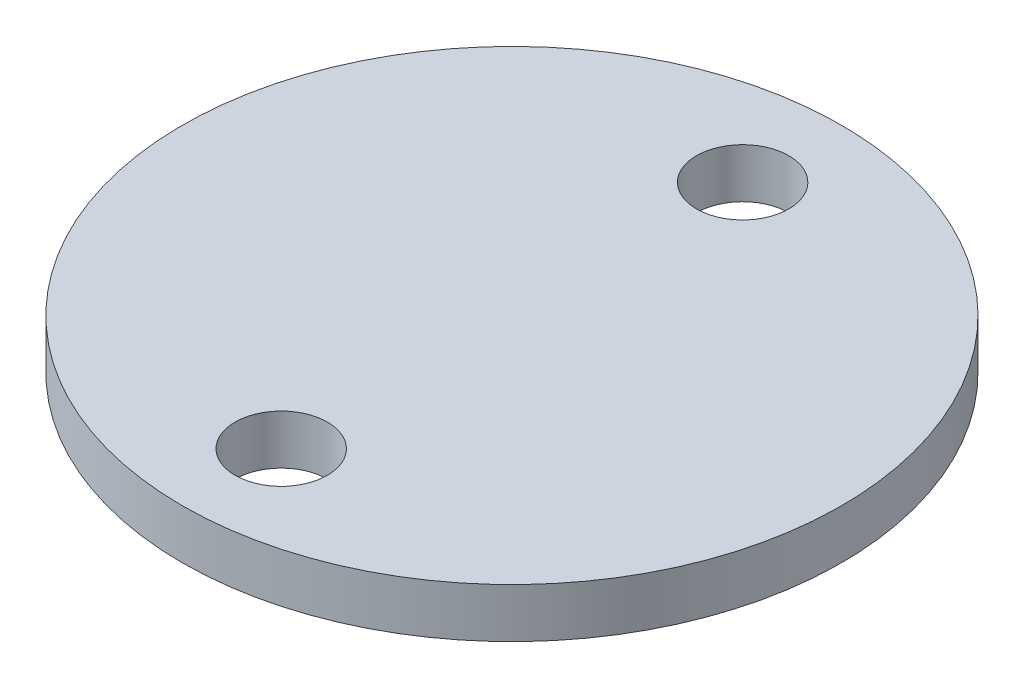
ISO-10303-21;
HEADER;
FILE_DESCRIPTION(('STEP AP214'),'2;1');
FILE_NAME('part.step','',(''),(''),'','','');
FILE_SCHEMA(('AUTOMOTIVE_DESIGN { 1 0 10303 214 1 1 1 1 }'));
ENDSEC;
DATA;
#1=APPLICATION_CONTEXT('core data for automotive mechanical design processes');
#2=APPLICATION_PROTOCOL_DEFINITION('international standard','automotive_design',2000,#1);
#3=PRODUCT_CONTEXT('',#1,'mechanical');
#4=PRODUCT('Part','Part','',(#3));
#5=PRODUCT_RELATED_PRODUCT_CATEGORY('part','',(#4));
#6=PRODUCT_DEFINITION_FORMATION('','',#4);
#7=PRODUCT_DEFINITION_CONTEXT('part definition',#1,'design');
#8=PRODUCT_DEFINITION('design','',#6,#7);
#9=PRODUCT_DEFINITION_SHAPE('','',#8);
#10=(LENGTH_UNIT() NAMED_UNIT(*) SI_UNIT(.MILLI.,.METRE.));
#11=(NAMED_UNIT(*) PLANE_ANGLE_UNIT() SI_UNIT($,.RADIAN.));
#12=(NAMED_UNIT(*) SI_UNIT($,.STERADIAN.) SOLID_ANGLE_UNIT());
#13=UNCERTAINTY_MEASURE_WITH_UNIT(LENGTH_MEASURE(1.E-05),#10,'distance_accuracy_value','');
#14=(GEOMETRIC_REPRESENTATION_CONTEXT(3) GLOBAL_UNCERTAINTY_ASSIGNED_CONTEXT((#13)) GLOBAL_UNIT_ASSIGNED_CONTEXT((#10,
#11,#12)) REPRESENTATION_CONTEXT('',''));
#15=CARTESIAN_POINT('',(0.,0.,0.));
#16=DIRECTION('',(0.,0.,1.));
#17=DIRECTION('',(1.,0.,0.));
#18=AXIS2_PLACEMENT_3D('',#15,#16,#17);
#19=CARTESIAN_POINT('',(0.,-1.5,0.));
#20=DIRECTION('',(0.,1.,0.));
#21=DIRECTION('',(0.,0.,1.));
#22=AXIS2_PLACEMENT_3D('',#19,#20,#21);
#23=PLANE('',#22);
#24=CARTESIAN_POINT('',(0.,-1.5,-7.));
#25=DIRECTION('',(0.,1.,0.));
#26=DIRECTION('',(0.,0.,1.));
#27=AXIS2_PLACEMENT_3D('',#24,#25,#26);
#28=CIRCLE('',#27,1.4);
#29=CARTESIAN_POINT('',(0.,-1.5,-5.6));
#30=VERTEX_POINT('',#29);
#31=EDGE_CURVE('E118',#30,#30,#28,.T.);
#32=ORIENTED_EDGE('',*,*,#31,.T.);
#33=EDGE_LOOP('',(#32));
#34=FACE_BOUND('',#33,.T.);
#35=CARTESIAN_POINT('',(0.,-1.5,7.));
#36=DIRECTION('',(0.,1.,0.));
#37=DIRECTION('',(0.,0.,1.));
#38=AXIS2_PLACEMENT_3D('',#35,#36,#37);
#39=CIRCLE('',#38,1.4);
#40=CARTESIAN_POINT('',(0.,-1.5,8.4));
#41=VERTEX_POINT('',#40);
#42=EDGE_CURVE('E117',#41,#41,#39,.T.);
#43=ORIENTED_EDGE('',*,*,#42,.T.);
#44=EDGE_LOOP('',(#43));
#45=FACE_BOUND('',#44,.T.);
#46=CARTESIAN_POINT('',(0.,-1.5,0.));
#47=DIRECTION('',(0.,1.,0.));
#48=DIRECTION('',(0.,0.,1.));
#49=AXIS2_PLACEMENT_3D('',#46,#47,#48);
#50=CIRCLE('',#49,10.);
#51=CARTESIAN_POINT('',(0.,-1.5,10.));
#52=VERTEX_POINT('',#51);
#53=EDGE_CURVE('E134',#52,#52,#50,.T.);
#54=ORIENTED_EDGE('',*,*,#53,.F.);
#55=EDGE_LOOP('',(#54));
#56=FACE_BOUND('',#55,.T.);
#57=CARTESIAN_POINT('',(0.,-1.5,0.));
#58=DIRECTION('',(0.,1.,0.));
#59=DIRECTION('',(0.,0.,1.));
#60=AXIS2_PLACEMENT_3D('',#57,#58,#59);
#61=CIRCLE('',#60,3.5);
#62=CARTESIAN_POINT('',(0.,-1.5,3.5));
#63=VERTEX_POINT('',#62);
#64=EDGE_CURVE('E138',#63,#63,#61,.F.);
#65=ORIENTED_EDGE('',*,*,#64,.F.);
#66=EDGE_LOOP('',(#65));
#67=FACE_BOUND('',#66,.T.);
#68=ADVANCED_FACE('F45',(#34,#45,#56,#67),#23,.F.);
#69=CARTESIAN_POINT('',(0.,-1.5,0.));
#70=DIRECTION('',(0.,1.,0.));
#71=DIRECTION('',(0.,0.,1.));
#72=AXIS2_PLACEMENT_3D('',#69,#70,#71);
#73=CYLINDRICAL_SURFACE('',#72,10.);
#74=ORIENTED_EDGE('',*,*,#53,.T.);
#75=EDGE_LOOP('',(#74));
#76=FACE_BOUND('',#75,.T.);
#77=CARTESIAN_POINT('',(0.,0.,0.));
#78=DIRECTION('',(0.,1.,0.));
#79=DIRECTION('',(0.,0.,1.));
#80=AXIS2_PLACEMENT_3D('',#77,#78,#79);
#81=CIRCLE('',#80,10.);
#82=CARTESIAN_POINT('',(0.,0.,10.));
#83=VERTEX_POINT('',#82);
#84=EDGE_CURVE('E122',#83,#83,#81,.T.);
#85=ORIENTED_EDGE('',*,*,#84,.F.);
#86=EDGE_LOOP('',(#85));
#87=FACE_BOUND('',#86,.T.);
#88=ADVANCED_FACE('F160',(#76,#87),#73,.T.);
#89=CARTESIAN_POINT('',(0.,0.,0.));
#90=DIRECTION('',(0.,1.,0.));
#91=DIRECTION('',(0.,0.,1.));
#92=AXIS2_PLACEMENT_3D('',#89,#90,#91);
#93=PLANE('',#92);
#94=CARTESIAN_POINT('',(0.,0.,-7.));
#95=DIRECTION('',(0.,1.,0.));
#96=DIRECTION('',(0.,0.,1.));
#97=AXIS2_PLACEMENT_3D('',#94,#95,#96);
#98=CIRCLE('',#97,1.4);
#99=CARTESIAN_POINT('',(0.,0.,-5.6));
#100=VERTEX_POINT('',#99);
#101=EDGE_CURVE('E123',#100,#100,#98,.T.);
#102=ORIENTED_EDGE('',*,*,#101,.F.);
#103=EDGE_LOOP('',(#102));
#104=FACE_BOUND('',#103,.T.);
#105=CARTESIAN_POINT('',(0.,0.,7.));
#106=DIRECTION('',(0.,1.,0.));
#107=DIRECTION('',(0.,0.,1.));
#108=AXIS2_PLACEMENT_3D('',#105,#106,#107);
#109=CIRCLE('',#108,1.4);
#110=CARTESIAN_POINT('',(0.,0.,8.4));
#111=VERTEX_POINT('',#110);
#112=EDGE_CURVE('E127',#111,#111,#109,.T.);
#113=ORIENTED_EDGE('',*,*,#112,.F.);
#114=EDGE_LOOP('',(#113));
#115=FACE_BOUND('',#114,.T.);
#116=ORIENTED_EDGE('',*,*,#84,.T.);
#117=EDGE_LOOP('',(#116));
#118=FACE_BOUND('',#117,.T.);
#119=ADVANCED_FACE('F164',(#104,#115,#118),#93,.T.);
#120=CARTESIAN_POINT('',(0.,-1.5,7.));
#121=DIRECTION('',(0.,1.,0.));
#122=DIRECTION('',(0.,0.,1.));
#123=AXIS2_PLACEMENT_3D('',#120,#121,#122);
#124=CYLINDRICAL_SURFACE('',#123,1.4);
#125=ORIENTED_EDGE('',*,*,#42,.F.);
#126=EDGE_LOOP('',(#125));
#127=FACE_BOUND('',#126,.T.);
#128=ORIENTED_EDGE('',*,*,#112,.T.);
#129=EDGE_LOOP('',(#128));
#130=FACE_BOUND('',#129,.T.);
#131=ADVANCED_FACE('F168',(#127,#130),#124,.F.);
#132=CARTESIAN_POINT('',(0.,-1.5,-7.));
#133=DIRECTION('',(0.,1.,0.));
#134=DIRECTION('',(0.,0.,1.));
#135=AXIS2_PLACEMENT_3D('',#132,#133,#134);
#136=CYLINDRICAL_SURFACE('',#135,1.4);
#137=ORIENTED_EDGE('',*,*,#31,.F.);
#138=EDGE_LOOP('',(#137));
#139=FACE_BOUND('',#138,.T.);
#140=ORIENTED_EDGE('',*,*,#101,.T.);
#141=EDGE_LOOP('',(#140));
#142=FACE_BOUND('',#141,.T.);
#143=ADVANCED_FACE('F174',(#139,#142),#136,.F.);
#144=CARTESIAN_POINT('',(0.,-5.,0.));
#145=DIRECTION('',(0.,-1.,0.));
#146=DIRECTION('',(0.,0.,-1.));
#147=AXIS2_PLACEMENT_3D('',#144,#145,#146);
#148=PLANE('',#147);
#149=CARTESIAN_POINT('',(0.,-5.,0.));
#150=DIRECTION('',(0.,-1.,0.));
#151=DIRECTION('',(0.,0.,-1.));
#152=AXIS2_PLACEMENT_3D('',#149,#150,#151);
#153=CIRCLE('',#152,3.08);
#154=CARTESIAN_POINT('',(2.6752986885261,-5.,-1.52616412196413));
#155=VERTEX_POINT('',#154);
#156=CARTESIAN_POINT('',(2.47560454785578,-5.,1.83242520246689));
#157=VERTEX_POINT('',#156);
#158=EDGE_CURVE('E67',#155,#157,#153,.F.);
#159=ORIENTED_EDGE('',*,*,#158,.T.);
#160=DIRECTION('',(-0.0593529225780543,0.,0.998237061314317));
#161=VECTOR('',#160,1.);
#162=CARTESIAN_POINT('',(2.57545161819094,-5.,0.15313054025138));
#163=LINE('',#162,#161);
#164=EDGE_CURVE('E60',#157,#155,#163,.F.);
#165=ORIENTED_EDGE('',*,*,#164,.T.);
#166=EDGE_LOOP('',(#159,#165));
#167=FACE_BOUND('',#166,.T.);
#168=CARTESIAN_POINT('',(0.,-5.,0.));
#169=DIRECTION('',(0.,-1.,0.));
#170=DIRECTION('',(0.,0.,-1.));
#171=AXIS2_PLACEMENT_3D('',#168,#169,#170);
#172=CIRCLE('',#171,3.5);
#173=CARTESIAN_POINT('',(0.,-5.,-3.5));
#174=VERTEX_POINT('',#173);
#175=EDGE_CURVE('E98',#174,#174,#172,.T.);
#176=ORIENTED_EDGE('',*,*,#175,.T.);
#177=EDGE_LOOP('',(#176));
#178=FACE_BOUND('',#177,.T.);
#179=ADVANCED_FACE('F178',(#167,#178),#148,.T.);
#180=CARTESIAN_POINT('',(0.,-5.,0.));
#181=DIRECTION('',(0.,1.,0.));
#182=DIRECTION('',(0.,0.,1.));
#183=AXIS2_PLACEMENT_3D('',#180,#181,#182);
#184=CYLINDRICAL_SURFACE('',#183,3.5);
#185=ORIENTED_EDGE('',*,*,#175,.F.);
#186=EDGE_LOOP('',(#185));
#187=FACE_BOUND('',#186,.T.);
#188=ORIENTED_EDGE('',*,*,#64,.T.);
#189=EDGE_LOOP('',(#188));
#190=FACE_BOUND('',#189,.T.);
#191=ADVANCED_FACE('F180',(#187,#190),#184,.T.);
#192=CARTESIAN_POINT('',(0.,-5.,0.));
#193=DIRECTION('',(0.,1.,0.));
#194=DIRECTION('',(0.,0.,1.));
#195=AXIS2_PLACEMENT_3D('',#192,#193,#194);
#196=CYLINDRICAL_SURFACE('',#195,2.58);
#197=DIRECTION('',(0.,1.,0.));
#198=VECTOR('',#197,1.);
#199=CARTESIAN_POINT('',(1.98573478321611,-5.,1.64719682209676));
#200=LINE('',#199,#198);
#201=CARTESIAN_POINT('',(1.98573478321611,-4.5,1.64719682209676));
#202=VERTEX_POINT('',#201);
#203=CARTESIAN_POINT('',(1.98573478321611,-1.5,1.64719682209676));
#204=VERTEX_POINT('',#203);
#205=EDGE_CURVE('E99',#202,#204,#200,.T.);
#206=ORIENTED_EDGE('',*,*,#205,.F.);
#207=CARTESIAN_POINT('',(0.,-4.5,0.));
#208=DIRECTION('',(0.,-1.,0.));
#209=DIRECTION('',(0.,0.,-1.));
#210=AXIS2_PLACEMENT_3D('',#207,#208,#209);
#211=CIRCLE('',#210,2.58);
#212=CARTESIAN_POINT('',(2.16693139185145,-4.5,-1.40028866417205));
#213=VERTEX_POINT('',#212);
#214=EDGE_CURVE('E11',#202,#213,#211,.T.);
#215=ORIENTED_EDGE('',*,*,#214,.T.);
#216=DIRECTION('',(0.,1.,0.));
#217=VECTOR('',#216,1.);
#218=CARTESIAN_POINT('',(2.16693139185145,-5.,-1.40028866417205));
#219=LINE('',#218,#217);
#220=CARTESIAN_POINT('',(2.16693139185145,-1.5,-1.40028866417205));
#221=VERTEX_POINT('',#220);
#222=EDGE_CURVE('E87',#213,#221,#219,.T.);
#223=ORIENTED_EDGE('',*,*,#222,.T.);
#224=CARTESIAN_POINT('',(0.,-1.5,0.));
#225=DIRECTION('',(0.,-1.,0.));
#226=DIRECTION('',(0.,0.,-1.));
#227=AXIS2_PLACEMENT_3D('',#224,#225,#226);
#228=CIRCLE('',#227,2.58);
#229=EDGE_CURVE('E92',#204,#221,#228,.T.);
#230=ORIENTED_EDGE('',*,*,#229,.F.);
#231=EDGE_LOOP('',(#206,#215,#223,#230));
#232=FACE_BOUND('',#231,.T.);
#233=ADVANCED_FACE('F90',(#232),#196,.F.);
#234=CARTESIAN_POINT('',(1.98573478321611,-5.,1.64719682209676));
#235=DIRECTION('',(-0.998237061314317,0.,-0.0593529225780542));
#236=DIRECTION('',(-0.0593529225780543,0.,0.998237061314317));
#237=AXIS2_PLACEMENT_3D('',#234,#235,#236);
#238=PLANE('',#237);
#239=ORIENTED_EDGE('',*,*,#222,.F.);
#240=DIRECTION('',(-0.0593529225780543,0.,0.998237061314317));
#241=VECTOR('',#240,1.);
#242=CARTESIAN_POINT('',(1.98573478321611,-4.5,1.64719682209676));
#243=LINE('',#242,#241);
#244=EDGE_CURVE('E145',#213,#202,#243,.T.);
#245=ORIENTED_EDGE('',*,*,#244,.T.);
#246=ORIENTED_EDGE('',*,*,#205,.T.);
#247=DIRECTION('',(-0.0593529225780542,0.,0.998237061314317));
#248=VECTOR('',#247,1.);
#249=CARTESIAN_POINT('',(1.98573478321611,-1.5,1.64719682209676));
#250=LINE('',#249,#248);
#251=EDGE_CURVE('E101',#221,#204,#250,.T.);
#252=ORIENTED_EDGE('',*,*,#251,.F.);
#253=EDGE_LOOP('',(#239,#245,#246,#252));
#254=FACE_BOUND('',#253,.T.);
#255=ADVANCED_FACE('F102',(#254),#238,.T.);
#256=ORIENTED_EDGE('',*,*,#251,.T.);
#257=ORIENTED_EDGE('',*,*,#229,.T.);
#258=EDGE_LOOP('',(#256,#257));
#259=FACE_BOUND('',#258,.T.);
#260=ADVANCED_FACE('F106',(#259),#23,.F.);
#261=CARTESIAN_POINT('',(0.,-4.5,0.));
#262=DIRECTION('',(0.,-1.,0.));
#263=DIRECTION('',(0.,0.,-1.));
#264=AXIS2_PLACEMENT_3D('',#261,#262,#263);
#265=TOROIDAL_SURFACE('',#264,3.08,0.5);
#266=CARTESIAN_POINT('',(1.98573478321611,-4.5,1.64719682209676));
#267=CARTESIAN_POINT('',(1.98570751333688,-4.5271506255322,1.64718405097706));
#268=CARTESIAN_POINT('',(1.98789750324852,-4.5542851739877,1.64805045423538));
#269=CARTESIAN_POINT('',(1.99650079260076,-4.60771122406625,1.6514431086882));
#270=CARTESIAN_POINT('',(2.00290487573119,-4.63400443442097,1.65396573765529));
#271=CARTESIAN_POINT('',(2.01972634119453,-4.68506043705291,1.66057294011781));
#272=CARTESIAN_POINT('',(2.03014350480648,-4.70982331265113,1.66465742848867));
#273=CARTESIAN_POINT('',(2.0546292670491,-4.75717862253918,1.67422008665459));
#274=CARTESIAN_POINT('',(2.06869860023212,-4.77977061895126,1.67969853680953));
#275=CARTESIAN_POINT('',(2.10039768824029,-4.82270912330445,1.69198337061502));
#276=CARTESIAN_POINT('',(2.11809954830483,-4.84299464958633,1.6988165335803));
#277=CARTESIAN_POINT('',(2.15633334761117,-4.88026896298054,1.71349435377744));
#278=CARTESIAN_POINT('',(2.17686629977642,-4.89725656488176,1.72133937297156));
#279=CARTESIAN_POINT('',(2.2212021491486,-4.92827824715827,1.73817852504377));
#280=CARTESIAN_POINT('',(2.24511254471425,-4.94213877843521,1.74720908046775));
#281=CARTESIAN_POINT('',(2.29474956357017,-4.96555555881288,1.76583477876804));
#282=CARTESIAN_POINT('',(2.32047589026668,-4.97511250893911,1.77542982940362));
#283=CARTESIAN_POINT('',(2.36684548801317,-4.98800260185666,1.79261148046861));
#284=CARTESIAN_POINT('',(2.38725772677416,-4.99227173905859,1.8001384617546));
#285=CARTESIAN_POINT('',(2.42841737025624,-4.99812823963347,1.81524144760828));
#286=CARTESIAN_POINT('',(2.44916408473136,-4.99972055180635,1.8228173356604));
#287=CARTESIAN_POINT('',(2.47181280291026,-4.9999888117942,1.8310481463482));
#288=CARTESIAN_POINT('',(2.47370871831033,-5.00000002968233,1.83173684146826));
#289=CARTESIAN_POINT('',(2.47560454785578,-5.,1.83242520246689));
#290=B_SPLINE_CURVE_WITH_KNOTS('',3,(#266,#267,#268,#269,#270,#271,#272,#273,#274,#275,#276,
#277,#278,#279,#280,#281,#282,#283,#284,#285,#286,#287,#288,#289),.UNSPECIFIED.,.F.,.F.,(4,2,2,
2,2,2,2,2,2,2,2,4),(0.,0.0813252181337499,0.162473164820037,0.243616689405507,0.32477654686089,
0.407738092583746,0.490729398134437,0.577570255720961,0.664396962372477,0.730759901813731,
0.797000016809044,0.80305134160449),.UNSPECIFIED.);
#291=EDGE_CURVE('E110',#157,#202,#290,.F.);
#292=ORIENTED_EDGE('',*,*,#291,.F.);
#293=ORIENTED_EDGE('',*,*,#158,.F.);
#294=CARTESIAN_POINT('',(2.16693139185145,-4.5,-1.40028866417205));
#295=CARTESIAN_POINT('',(2.16690280076928,-4.5271506255322,-1.40027921441904));
#296=CARTESIAN_POINT('',(2.16918002683978,-4.5542851739877,-1.40088000709786));
#297=CARTESIAN_POINT('',(2.17812471931228,-4.60771122406625,-1.40322929815836));
#298=CARTESIAN_POINT('',(2.18478260511645,-4.63400443442097,-1.40497529193432));
#299=CARTESIAN_POINT('',(2.2022684851473,-4.68506043705291,-1.40954265706773));
#300=CARTESIAN_POINT('',(2.21309625210706,-4.70982331265112,-1.41236396981803));
#301=CARTESIAN_POINT('',(2.23854264119212,-4.75717862253917,-1.4189577749662));
#302=CARTESIAN_POINT('',(2.25316202591614,-4.77977061895126,-1.42273045870674));
#303=CARTESIAN_POINT('',(2.28609348748712,-4.82270912330445,-1.43117250590971));
#304=CARTESIAN_POINT('',(2.30448033481026,-4.84299464958633,-1.43585991578835));
#305=CARTESIAN_POINT('',(2.34418402780628,-4.88026896298054,-1.44590374860331));
#306=CARTESIAN_POINT('',(2.3655019221573,-4.89725656488176,-1.45126041092373));
#307=CARTESIAN_POINT('',(2.41152078341097,-4.92827824715827,-1.46272727583874));
#308=CARTESIAN_POINT('',(2.43633280723538,-4.94213877843521,-1.46886090617554));
#309=CARTESIAN_POINT('',(2.48782718798468,-4.96555555881288,-1.48147355971563));
#310=CARTESIAN_POINT('',(2.51450923947527,-4.97511250893911,-1.48795252647342));
#311=CARTESIAN_POINT('',(2.56258810520735,-4.98800260185666,-1.49951848507645));
#312=CARTESIAN_POINT('',(2.58374845024257,-4.99227173905859,-1.504573654362));
#313=CARTESIAN_POINT('',(2.62640775393924,-4.99812823963347,-1.51469295480142));
#314=CARTESIAN_POINT('',(2.64790601341119,-4.99972055180635,-1.51975705205241));
#315=CARTESIAN_POINT('',(2.67137048203455,-4.9999888117942,-1.52524607673345));
#316=CARTESIAN_POINT('',(2.67333464770131,-5.00000002968233,-1.52570526014573));
#317=CARTESIAN_POINT('',(2.6752986885261,-5.,-1.52616412196412));
#318=B_SPLINE_CURVE_WITH_KNOTS('',3,(#294,#295,#296,#297,#298,#299,#300,#301,#302,#303,#304,
#305,#306,#307,#308,#309,#310,#311,#312,#313,#314,#315,#316,#317),.UNSPECIFIED.,.F.,.F.,(4,2,2,
2,2,2,2,2,2,2,2,4),(0.,0.0813252181337499,0.162473164820037,0.243616689405506,0.32477654686089,
0.407738092583746,0.490729398134437,0.577570255720962,0.664396962372478,0.73075990181373,
0.797000016809042,0.803051341604488),.UNSPECIFIED.);
#319=EDGE_CURVE('E50',#213,#155,#318,.T.);
#320=ORIENTED_EDGE('',*,*,#319,.F.);
#321=ORIENTED_EDGE('',*,*,#214,.F.);
#322=EDGE_LOOP('',(#292,#293,#320,#321));
#323=FACE_BOUND('',#322,.T.);
#324=ADVANCED_FACE('F47',(#323),#265,.T.);
#325=CARTESIAN_POINT('',(2.48485331387327,-4.5,1.67687328338579));
#326=DIRECTION('',(-0.0593529225780543,0.,0.998237061314317));
#327=DIRECTION('',(0.998237061314317,0.,0.0593529225780542));
#328=AXIS2_PLACEMENT_3D('',#325,#326,#327);
#329=CYLINDRICAL_SURFACE('',#328,0.5);
#330=ORIENTED_EDGE('',*,*,#319,.T.);
#331=ORIENTED_EDGE('',*,*,#164,.F.);
#332=ORIENTED_EDGE('',*,*,#291,.T.);
#333=ORIENTED_EDGE('',*,*,#244,.F.);
#334=EDGE_LOOP('',(#330,#331,#332,#333));
#335=FACE_BOUND('',#334,.T.);
#336=ADVANCED_FACE('F156',(#335),#329,.T.);
#337=CLOSED_SHELL('',(#68,#88,#119,#131,#143,#179,#191,#233,#255,#260,#324,#336));
#338=MANIFOLD_SOLID_BREP('B2',#337);
#339=ADVANCED_BREP_SHAPE_REPRESENTATION('',(#18,#338),#14);
#340=SHAPE_DEFINITION_REPRESENTATION(#9,#339);
ENDSEC;
END-ISO-10303-21;
